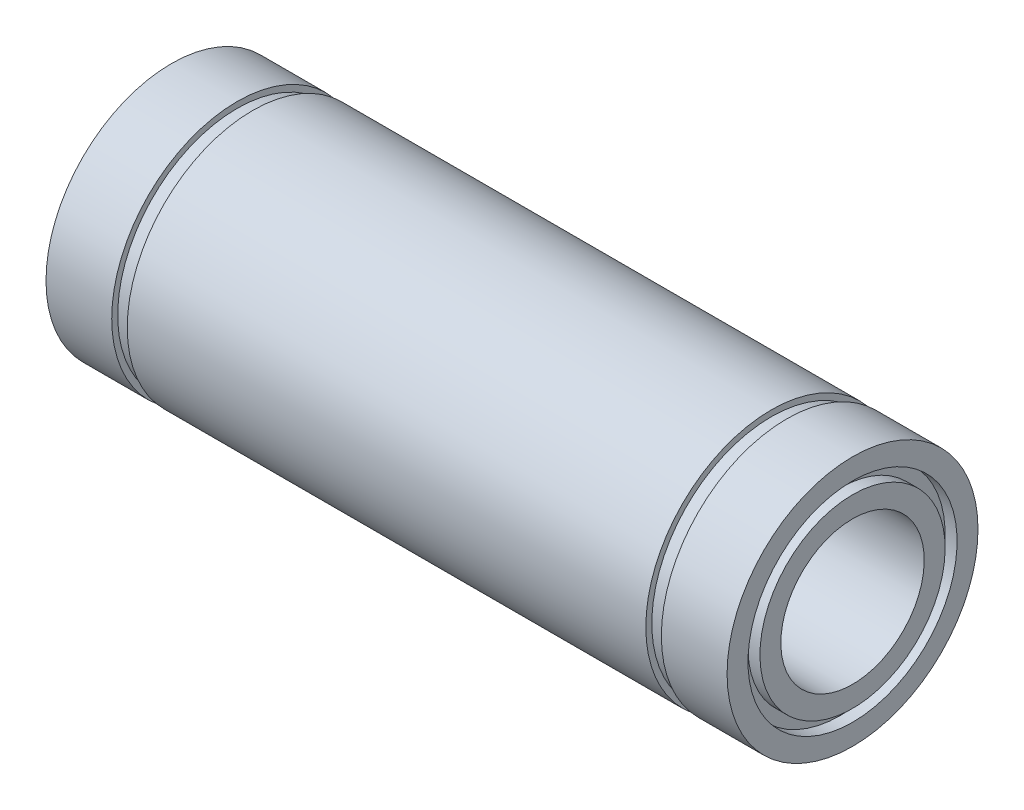
ISO-10303-21;
HEADER;
FILE_DESCRIPTION(('STEP AP214'),'2;1');
FILE_NAME('part.step','',(''),(''),'','','');
FILE_SCHEMA(('AUTOMOTIVE_DESIGN { 1 0 10303 214 1 1 1 1 }'));
ENDSEC;
DATA;
#1=APPLICATION_CONTEXT('core data for automotive mechanical design processes');
#2=APPLICATION_PROTOCOL_DEFINITION('international standard','automotive_design',2000,#1);
#3=PRODUCT_CONTEXT('',#1,'mechanical');
#4=PRODUCT('Part','Part','',(#3));
#5=PRODUCT_RELATED_PRODUCT_CATEGORY('part','',(#4));
#6=PRODUCT_DEFINITION_FORMATION('','',#4);
#7=PRODUCT_DEFINITION_CONTEXT('part definition',#1,'design');
#8=PRODUCT_DEFINITION('design','',#6,#7);
#9=PRODUCT_DEFINITION_SHAPE('','',#8);
#10=(LENGTH_UNIT() NAMED_UNIT(*) SI_UNIT(.MILLI.,.METRE.));
#11=(NAMED_UNIT(*) PLANE_ANGLE_UNIT() SI_UNIT($,.RADIAN.));
#12=(NAMED_UNIT(*) SI_UNIT($,.STERADIAN.) SOLID_ANGLE_UNIT());
#13=UNCERTAINTY_MEASURE_WITH_UNIT(LENGTH_MEASURE(1.E-05),#10,'distance_accuracy_value','');
#14=(GEOMETRIC_REPRESENTATION_CONTEXT(3) GLOBAL_UNCERTAINTY_ASSIGNED_CONTEXT((#13)) GLOBAL_UNIT_ASSIGNED_CONTEXT((#10,
#11,#12)) REPRESENTATION_CONTEXT('',''));
#15=CARTESIAN_POINT('',(0.,0.,0.));
#16=DIRECTION('',(0.,0.,1.));
#17=DIRECTION('',(1.,0.,0.));
#18=AXIS2_PLACEMENT_3D('',#15,#16,#17);
#19=CARTESIAN_POINT('',(-28.5,8.75,0.));
#20=DIRECTION('',(-1.,0.,0.));
#21=DIRECTION('',(0.,-1.,0.));
#22=AXIS2_PLACEMENT_3D('',#19,#20,#21);
#23=PLANE('',#22);
#24=CARTESIAN_POINT('',(-28.5,0.,0.));
#25=DIRECTION('',(1.,0.,0.));
#26=DIRECTION('',(0.,1.,0.));
#27=AXIS2_PLACEMENT_3D('',#24,#25,#26);
#28=CIRCLE('',#27,8.75);
#29=CARTESIAN_POINT('',(-28.5,8.75,0.));
#30=VERTEX_POINT('',#29);
#31=EDGE_CURVE('E123',#30,#30,#28,.T.);
#32=ORIENTED_EDGE('',*,*,#31,.T.);
#33=EDGE_LOOP('',(#32));
#34=FACE_BOUND('',#33,.T.);
#35=CARTESIAN_POINT('',(-28.5,0.,0.));
#36=DIRECTION('',(1.,0.,0.));
#37=DIRECTION('',(0.,1.,0.));
#38=AXIS2_PLACEMENT_3D('',#35,#36,#37);
#39=CIRCLE('',#38,10.5);
#40=CARTESIAN_POINT('',(-28.5,10.5,0.));
#41=VERTEX_POINT('',#40);
#42=EDGE_CURVE('E10',#41,#41,#39,.T.);
#43=ORIENTED_EDGE('',*,*,#42,.F.);
#44=EDGE_LOOP('',(#43));
#45=FACE_BOUND('',#44,.T.);
#46=ADVANCED_FACE('F40',(#34,#45),#23,.T.);
#47=CARTESIAN_POINT('',(0.,0.,0.));
#48=DIRECTION('',(1.,0.,0.));
#49=DIRECTION('',(0.,1.,0.));
#50=AXIS2_PLACEMENT_3D('',#47,#48,#49);
#51=CYLINDRICAL_SURFACE('',#50,10.5);
#52=ORIENTED_EDGE('',*,*,#42,.T.);
#53=EDGE_LOOP('',(#52));
#54=FACE_BOUND('',#53,.T.);
#55=CARTESIAN_POINT('',(-23.,0.,0.));
#56=DIRECTION('',(1.,0.,0.));
#57=DIRECTION('',(0.,1.,0.));
#58=AXIS2_PLACEMENT_3D('',#55,#56,#57);
#59=CIRCLE('',#58,10.5);
#60=CARTESIAN_POINT('',(-23.,10.5,0.));
#61=VERTEX_POINT('',#60);
#62=EDGE_CURVE('E47',#61,#61,#59,.T.);
#63=ORIENTED_EDGE('',*,*,#62,.F.);
#64=EDGE_LOOP('',(#63));
#65=FACE_BOUND('',#64,.T.);
#66=ADVANCED_FACE('F142',(#54,#65),#51,.T.);
#67=CARTESIAN_POINT('',(-23.,10.5,0.));
#68=DIRECTION('',(1.,0.,0.));
#69=DIRECTION('',(0.,1.,0.));
#70=AXIS2_PLACEMENT_3D('',#67,#68,#69);
#71=PLANE('',#70);
#72=ORIENTED_EDGE('',*,*,#62,.T.);
#73=EDGE_LOOP('',(#72));
#74=FACE_BOUND('',#73,.T.);
#75=CARTESIAN_POINT('',(-23.,0.,0.));
#76=DIRECTION('',(1.,0.,0.));
#77=DIRECTION('',(0.,1.,0.));
#78=AXIS2_PLACEMENT_3D('',#75,#76,#77);
#79=CIRCLE('',#78,10.);
#80=CARTESIAN_POINT('',(-23.,10.,0.));
#81=VERTEX_POINT('',#80);
#82=EDGE_CURVE('E53',#81,#81,#79,.T.);
#83=ORIENTED_EDGE('',*,*,#82,.F.);
#84=EDGE_LOOP('',(#83));
#85=FACE_BOUND('',#84,.T.);
#86=ADVANCED_FACE('F146',(#74,#85),#71,.T.);
#87=CARTESIAN_POINT('',(0.,0.,0.));
#88=DIRECTION('',(1.,0.,0.));
#89=DIRECTION('',(0.,1.,0.));
#90=AXIS2_PLACEMENT_3D('',#87,#88,#89);
#91=CYLINDRICAL_SURFACE('',#90,10.);
#92=ORIENTED_EDGE('',*,*,#82,.T.);
#93=EDGE_LOOP('',(#92));
#94=FACE_BOUND('',#93,.T.);
#95=CARTESIAN_POINT('',(-21.7,0.,0.));
#96=DIRECTION('',(1.,0.,0.));
#97=DIRECTION('',(0.,1.,0.));
#98=AXIS2_PLACEMENT_3D('',#95,#96,#97);
#99=CIRCLE('',#98,10.);
#100=CARTESIAN_POINT('',(-21.7,10.,0.));
#101=VERTEX_POINT('',#100);
#102=EDGE_CURVE('E59',#101,#101,#99,.T.);
#103=ORIENTED_EDGE('',*,*,#102,.F.);
#104=EDGE_LOOP('',(#103));
#105=FACE_BOUND('',#104,.T.);
#106=ADVANCED_FACE('F150',(#94,#105),#91,.T.);
#107=CARTESIAN_POINT('',(-21.7,10.,0.));
#108=DIRECTION('',(-1.,0.,0.));
#109=DIRECTION('',(0.,-1.,0.));
#110=AXIS2_PLACEMENT_3D('',#107,#108,#109);
#111=PLANE('',#110);
#112=ORIENTED_EDGE('',*,*,#102,.T.);
#113=EDGE_LOOP('',(#112));
#114=FACE_BOUND('',#113,.T.);
#115=CARTESIAN_POINT('',(-21.7,0.,0.));
#116=DIRECTION('',(1.,0.,0.));
#117=DIRECTION('',(0.,1.,0.));
#118=AXIS2_PLACEMENT_3D('',#115,#116,#117);
#119=CIRCLE('',#118,10.5);
#120=CARTESIAN_POINT('',(-21.7,10.5,0.));
#121=VERTEX_POINT('',#120);
#122=EDGE_CURVE('E65',#121,#121,#119,.T.);
#123=ORIENTED_EDGE('',*,*,#122,.F.);
#124=EDGE_LOOP('',(#123));
#125=FACE_BOUND('',#124,.T.);
#126=ADVANCED_FACE('F156',(#114,#125),#111,.T.);
#127=CARTESIAN_POINT('',(0.,0.,0.));
#128=DIRECTION('',(1.,0.,0.));
#129=DIRECTION('',(0.,1.,0.));
#130=AXIS2_PLACEMENT_3D('',#127,#128,#129);
#131=CYLINDRICAL_SURFACE('',#130,10.5);
#132=ORIENTED_EDGE('',*,*,#122,.T.);
#133=EDGE_LOOP('',(#132));
#134=FACE_BOUND('',#133,.T.);
#135=CARTESIAN_POINT('',(21.7,0.,0.));
#136=DIRECTION('',(1.,0.,0.));
#137=DIRECTION('',(0.,1.,0.));
#138=AXIS2_PLACEMENT_3D('',#135,#136,#137);
#139=CIRCLE('',#138,10.5);
#140=CARTESIAN_POINT('',(21.7,10.5,0.));
#141=VERTEX_POINT('',#140);
#142=EDGE_CURVE('E69',#141,#141,#139,.T.);
#143=ORIENTED_EDGE('',*,*,#142,.F.);
#144=EDGE_LOOP('',(#143));
#145=FACE_BOUND('',#144,.T.);
#146=ADVANCED_FACE('F160',(#134,#145),#131,.T.);
#147=CARTESIAN_POINT('',(21.7,10.5,0.));
#148=DIRECTION('',(1.,0.,0.));
#149=DIRECTION('',(0.,1.,0.));
#150=AXIS2_PLACEMENT_3D('',#147,#148,#149);
#151=PLANE('',#150);
#152=ORIENTED_EDGE('',*,*,#142,.T.);
#153=EDGE_LOOP('',(#152));
#154=FACE_BOUND('',#153,.T.);
#155=CARTESIAN_POINT('',(21.7,0.,0.));
#156=DIRECTION('',(1.,0.,0.));
#157=DIRECTION('',(0.,1.,0.));
#158=AXIS2_PLACEMENT_3D('',#155,#156,#157);
#159=CIRCLE('',#158,10.);
#160=CARTESIAN_POINT('',(21.7,10.,0.));
#161=VERTEX_POINT('',#160);
#162=EDGE_CURVE('E73',#161,#161,#159,.T.);
#163=ORIENTED_EDGE('',*,*,#162,.F.);
#164=EDGE_LOOP('',(#163));
#165=FACE_BOUND('',#164,.T.);
#166=ADVANCED_FACE('F164',(#154,#165),#151,.T.);
#167=CARTESIAN_POINT('',(0.,0.,0.));
#168=DIRECTION('',(1.,0.,0.));
#169=DIRECTION('',(0.,1.,0.));
#170=AXIS2_PLACEMENT_3D('',#167,#168,#169);
#171=CYLINDRICAL_SURFACE('',#170,10.);
#172=ORIENTED_EDGE('',*,*,#162,.T.);
#173=EDGE_LOOP('',(#172));
#174=FACE_BOUND('',#173,.T.);
#175=CARTESIAN_POINT('',(23.,0.,0.));
#176=DIRECTION('',(1.,0.,0.));
#177=DIRECTION('',(0.,1.,0.));
#178=AXIS2_PLACEMENT_3D('',#175,#176,#177);
#179=CIRCLE('',#178,10.);
#180=CARTESIAN_POINT('',(23.,10.,0.));
#181=VERTEX_POINT('',#180);
#182=EDGE_CURVE('E76',#181,#181,#179,.T.);
#183=ORIENTED_EDGE('',*,*,#182,.F.);
#184=EDGE_LOOP('',(#183));
#185=FACE_BOUND('',#184,.T.);
#186=ADVANCED_FACE('F168',(#174,#185),#171,.T.);
#187=CARTESIAN_POINT('',(23.,10.,0.));
#188=DIRECTION('',(-1.,0.,0.));
#189=DIRECTION('',(0.,-1.,0.));
#190=AXIS2_PLACEMENT_3D('',#187,#188,#189);
#191=PLANE('',#190);
#192=ORIENTED_EDGE('',*,*,#182,.T.);
#193=EDGE_LOOP('',(#192));
#194=FACE_BOUND('',#193,.T.);
#195=CARTESIAN_POINT('',(23.,0.,0.));
#196=DIRECTION('',(1.,0.,0.));
#197=DIRECTION('',(0.,1.,0.));
#198=AXIS2_PLACEMENT_3D('',#195,#196,#197);
#199=CIRCLE('',#198,10.5);
#200=CARTESIAN_POINT('',(23.,10.5,0.));
#201=VERTEX_POINT('',#200);
#202=EDGE_CURVE('E80',#201,#201,#199,.T.);
#203=ORIENTED_EDGE('',*,*,#202,.F.);
#204=EDGE_LOOP('',(#203));
#205=FACE_BOUND('',#204,.T.);
#206=ADVANCED_FACE('F172',(#194,#205),#191,.T.);
#207=CARTESIAN_POINT('',(0.,0.,0.));
#208=DIRECTION('',(1.,0.,0.));
#209=DIRECTION('',(0.,1.,0.));
#210=AXIS2_PLACEMENT_3D('',#207,#208,#209);
#211=CYLINDRICAL_SURFACE('',#210,10.5);
#212=ORIENTED_EDGE('',*,*,#202,.T.);
#213=EDGE_LOOP('',(#212));
#214=FACE_BOUND('',#213,.T.);
#215=CARTESIAN_POINT('',(28.5,0.,0.));
#216=DIRECTION('',(1.,0.,0.));
#217=DIRECTION('',(0.,1.,0.));
#218=AXIS2_PLACEMENT_3D('',#215,#216,#217);
#219=CIRCLE('',#218,10.5);
#220=CARTESIAN_POINT('',(28.5,10.5,0.));
#221=VERTEX_POINT('',#220);
#222=EDGE_CURVE('E84',#221,#221,#219,.T.);
#223=ORIENTED_EDGE('',*,*,#222,.F.);
#224=EDGE_LOOP('',(#223));
#225=FACE_BOUND('',#224,.T.);
#226=ADVANCED_FACE('F176',(#214,#225),#211,.T.);
#227=CARTESIAN_POINT('',(28.5,10.5,0.));
#228=DIRECTION('',(1.,0.,0.));
#229=DIRECTION('',(0.,1.,0.));
#230=AXIS2_PLACEMENT_3D('',#227,#228,#229);
#231=PLANE('',#230);
#232=ORIENTED_EDGE('',*,*,#222,.T.);
#233=EDGE_LOOP('',(#232));
#234=FACE_BOUND('',#233,.T.);
#235=CARTESIAN_POINT('',(28.5,0.,0.));
#236=DIRECTION('',(1.,0.,0.));
#237=DIRECTION('',(0.,1.,0.));
#238=AXIS2_PLACEMENT_3D('',#235,#236,#237);
#239=CIRCLE('',#238,8.74999999999999);
#240=CARTESIAN_POINT('',(28.5,8.75,0.));
#241=VERTEX_POINT('',#240);
#242=EDGE_CURVE('E87',#241,#241,#239,.T.);
#243=ORIENTED_EDGE('',*,*,#242,.F.);
#244=EDGE_LOOP('',(#243));
#245=FACE_BOUND('',#244,.T.);
#246=ADVANCED_FACE('F180',(#234,#245),#231,.T.);
#247=CARTESIAN_POINT('',(0.,0.,0.));
#248=DIRECTION('',(1.,0.,0.));
#249=DIRECTION('',(0.,1.,0.));
#250=AXIS2_PLACEMENT_3D('',#247,#248,#249);
#251=CYLINDRICAL_SURFACE('',#250,8.74999999999999);
#252=ORIENTED_EDGE('',*,*,#242,.T.);
#253=EDGE_LOOP('',(#252));
#254=FACE_BOUND('',#253,.T.);
#255=CARTESIAN_POINT('',(27.5,0.,0.));
#256=DIRECTION('',(1.,0.,0.));
#257=DIRECTION('',(0.,1.,0.));
#258=AXIS2_PLACEMENT_3D('',#255,#256,#257);
#259=CIRCLE('',#258,8.74999999999999);
#260=CARTESIAN_POINT('',(27.5,8.75,0.));
#261=VERTEX_POINT('',#260);
#262=EDGE_CURVE('E91',#261,#261,#259,.T.);
#263=ORIENTED_EDGE('',*,*,#262,.F.);
#264=EDGE_LOOP('',(#263));
#265=FACE_BOUND('',#264,.T.);
#266=ADVANCED_FACE('F184',(#254,#265),#251,.F.);
#267=CARTESIAN_POINT('',(27.5,8.75,0.));
#268=DIRECTION('',(1.,0.,0.));
#269=DIRECTION('',(0.,1.,0.));
#270=AXIS2_PLACEMENT_3D('',#267,#268,#269);
#271=PLANE('',#270);
#272=ORIENTED_EDGE('',*,*,#262,.T.);
#273=EDGE_LOOP('',(#272));
#274=FACE_BOUND('',#273,.T.);
#275=CARTESIAN_POINT('',(27.5,0.,0.));
#276=DIRECTION('',(1.,0.,0.));
#277=DIRECTION('',(0.,1.,0.));
#278=AXIS2_PLACEMENT_3D('',#275,#276,#277);
#279=CIRCLE('',#278,7.74999999999999);
#280=CARTESIAN_POINT('',(27.5,7.75,0.));
#281=VERTEX_POINT('',#280);
#282=EDGE_CURVE('E95',#281,#281,#279,.T.);
#283=ORIENTED_EDGE('',*,*,#282,.F.);
#284=EDGE_LOOP('',(#283));
#285=FACE_BOUND('',#284,.T.);
#286=ADVANCED_FACE('F188',(#274,#285),#271,.T.);
#287=CARTESIAN_POINT('',(0.,0.,0.));
#288=DIRECTION('',(1.,0.,0.));
#289=DIRECTION('',(0.,1.,0.));
#290=AXIS2_PLACEMENT_3D('',#287,#288,#289);
#291=CYLINDRICAL_SURFACE('',#290,7.74999999999999);
#292=ORIENTED_EDGE('',*,*,#282,.T.);
#293=EDGE_LOOP('',(#292));
#294=FACE_BOUND('',#293,.T.);
#295=CARTESIAN_POINT('',(28.5,0.,0.));
#296=DIRECTION('',(1.,0.,0.));
#297=DIRECTION('',(0.,1.,0.));
#298=AXIS2_PLACEMENT_3D('',#295,#296,#297);
#299=CIRCLE('',#298,7.74999999999999);
#300=CARTESIAN_POINT('',(28.5,7.74999999999999,0.));
#301=VERTEX_POINT('',#300);
#302=EDGE_CURVE('E99',#301,#301,#299,.T.);
#303=ORIENTED_EDGE('',*,*,#302,.F.);
#304=EDGE_LOOP('',(#303));
#305=FACE_BOUND('',#304,.T.);
#306=ADVANCED_FACE('F192',(#294,#305),#291,.T.);
#307=CARTESIAN_POINT('',(28.5,7.74999999999999,0.));
#308=DIRECTION('',(1.,0.,0.));
#309=DIRECTION('',(0.,1.,0.));
#310=AXIS2_PLACEMENT_3D('',#307,#308,#309);
#311=PLANE('',#310);
#312=ORIENTED_EDGE('',*,*,#302,.T.);
#313=EDGE_LOOP('',(#312));
#314=FACE_BOUND('',#313,.T.);
#315=CARTESIAN_POINT('',(28.5,0.,0.));
#316=DIRECTION('',(1.,0.,0.));
#317=DIRECTION('',(0.,1.,0.));
#318=AXIS2_PLACEMENT_3D('',#315,#316,#317);
#319=CIRCLE('',#318,6.);
#320=CARTESIAN_POINT('',(28.5,6.,0.));
#321=VERTEX_POINT('',#320);
#322=EDGE_CURVE('E103',#321,#321,#319,.T.);
#323=ORIENTED_EDGE('',*,*,#322,.F.);
#324=EDGE_LOOP('',(#323));
#325=FACE_BOUND('',#324,.T.);
#326=ADVANCED_FACE('F196',(#314,#325),#311,.T.);
#327=CARTESIAN_POINT('',(0.,0.,0.));
#328=DIRECTION('',(1.,0.,0.));
#329=DIRECTION('',(0.,1.,0.));
#330=AXIS2_PLACEMENT_3D('',#327,#328,#329);
#331=CYLINDRICAL_SURFACE('',#330,6.);
#332=ORIENTED_EDGE('',*,*,#322,.T.);
#333=EDGE_LOOP('',(#332));
#334=FACE_BOUND('',#333,.T.);
#335=CARTESIAN_POINT('',(-28.5,0.,0.));
#336=DIRECTION('',(1.,0.,0.));
#337=DIRECTION('',(0.,1.,0.));
#338=AXIS2_PLACEMENT_3D('',#335,#336,#337);
#339=CIRCLE('',#338,6.);
#340=CARTESIAN_POINT('',(-28.5,6.,0.));
#341=VERTEX_POINT('',#340);
#342=EDGE_CURVE('E107',#341,#341,#339,.T.);
#343=ORIENTED_EDGE('',*,*,#342,.F.);
#344=EDGE_LOOP('',(#343));
#345=FACE_BOUND('',#344,.T.);
#346=ADVANCED_FACE('F200',(#334,#345),#331,.F.);
#347=CARTESIAN_POINT('',(-28.5,6.,0.));
#348=DIRECTION('',(-1.,0.,0.));
#349=DIRECTION('',(0.,-1.,0.));
#350=AXIS2_PLACEMENT_3D('',#347,#348,#349);
#351=PLANE('',#350);
#352=ORIENTED_EDGE('',*,*,#342,.T.);
#353=EDGE_LOOP('',(#352));
#354=FACE_BOUND('',#353,.T.);
#355=CARTESIAN_POINT('',(-28.5,0.,0.));
#356=DIRECTION('',(1.,0.,0.));
#357=DIRECTION('',(0.,1.,0.));
#358=AXIS2_PLACEMENT_3D('',#355,#356,#357);
#359=CIRCLE('',#358,7.75);
#360=CARTESIAN_POINT('',(-28.5,7.75,0.));
#361=VERTEX_POINT('',#360);
#362=EDGE_CURVE('E111',#361,#361,#359,.T.);
#363=ORIENTED_EDGE('',*,*,#362,.F.);
#364=EDGE_LOOP('',(#363));
#365=FACE_BOUND('',#364,.T.);
#366=ADVANCED_FACE('F204',(#354,#365),#351,.T.);
#367=CARTESIAN_POINT('',(0.,0.,0.));
#368=DIRECTION('',(1.,0.,0.));
#369=DIRECTION('',(0.,1.,0.));
#370=AXIS2_PLACEMENT_3D('',#367,#368,#369);
#371=CYLINDRICAL_SURFACE('',#370,7.75);
#372=ORIENTED_EDGE('',*,*,#362,.T.);
#373=EDGE_LOOP('',(#372));
#374=FACE_BOUND('',#373,.T.);
#375=CARTESIAN_POINT('',(-27.5,0.,0.));
#376=DIRECTION('',(1.,0.,0.));
#377=DIRECTION('',(0.,1.,0.));
#378=AXIS2_PLACEMENT_3D('',#375,#376,#377);
#379=CIRCLE('',#378,7.75);
#380=CARTESIAN_POINT('',(-27.5,7.75,0.));
#381=VERTEX_POINT('',#380);
#382=EDGE_CURVE('E115',#381,#381,#379,.T.);
#383=ORIENTED_EDGE('',*,*,#382,.F.);
#384=EDGE_LOOP('',(#383));
#385=FACE_BOUND('',#384,.T.);
#386=ADVANCED_FACE('F138',(#374,#385),#371,.T.);
#387=CARTESIAN_POINT('',(-27.5,8.75,0.));
#388=DIRECTION('',(-1.,0.,0.));
#389=DIRECTION('',(0.,-1.,0.));
#390=AXIS2_PLACEMENT_3D('',#387,#388,#389);
#391=PLANE('',#390);
#392=ORIENTED_EDGE('',*,*,#382,.T.);
#393=EDGE_LOOP('',(#392));
#394=FACE_BOUND('',#393,.T.);
#395=CARTESIAN_POINT('',(-27.5,0.,0.));
#396=DIRECTION('',(1.,0.,0.));
#397=DIRECTION('',(0.,1.,0.));
#398=AXIS2_PLACEMENT_3D('',#395,#396,#397);
#399=CIRCLE('',#398,8.75);
#400=CARTESIAN_POINT('',(-27.5,8.75,0.));
#401=VERTEX_POINT('',#400);
#402=EDGE_CURVE('E119',#401,#401,#399,.T.);
#403=ORIENTED_EDGE('',*,*,#402,.F.);
#404=EDGE_LOOP('',(#403));
#405=FACE_BOUND('',#404,.T.);
#406=ADVANCED_FACE('F132',(#394,#405),#391,.T.);
#407=CARTESIAN_POINT('',(0.,0.,0.));
#408=DIRECTION('',(1.,0.,0.));
#409=DIRECTION('',(0.,1.,0.));
#410=AXIS2_PLACEMENT_3D('',#407,#408,#409);
#411=CYLINDRICAL_SURFACE('',#410,8.75);
#412=ORIENTED_EDGE('',*,*,#402,.T.);
#413=EDGE_LOOP('',(#412));
#414=FACE_BOUND('',#413,.T.);
#415=ORIENTED_EDGE('',*,*,#31,.F.);
#416=EDGE_LOOP('',(#415));
#417=FACE_BOUND('',#416,.T.);
#418=ADVANCED_FACE('F130',(#414,#417),#411,.F.);
#419=CLOSED_SHELL('',(#46,#66,#86,#106,#126,#146,#166,#186,#206,#226,#246,#266,#286,#306,#326,
#346,#366,#386,#406,#418));
#420=MANIFOLD_SOLID_BREP('B2',#419);
#421=ADVANCED_BREP_SHAPE_REPRESENTATION('',(#18,#420),#14);
#422=SHAPE_DEFINITION_REPRESENTATION(#9,#421);
ENDSEC;
END-ISO-10303-21;
